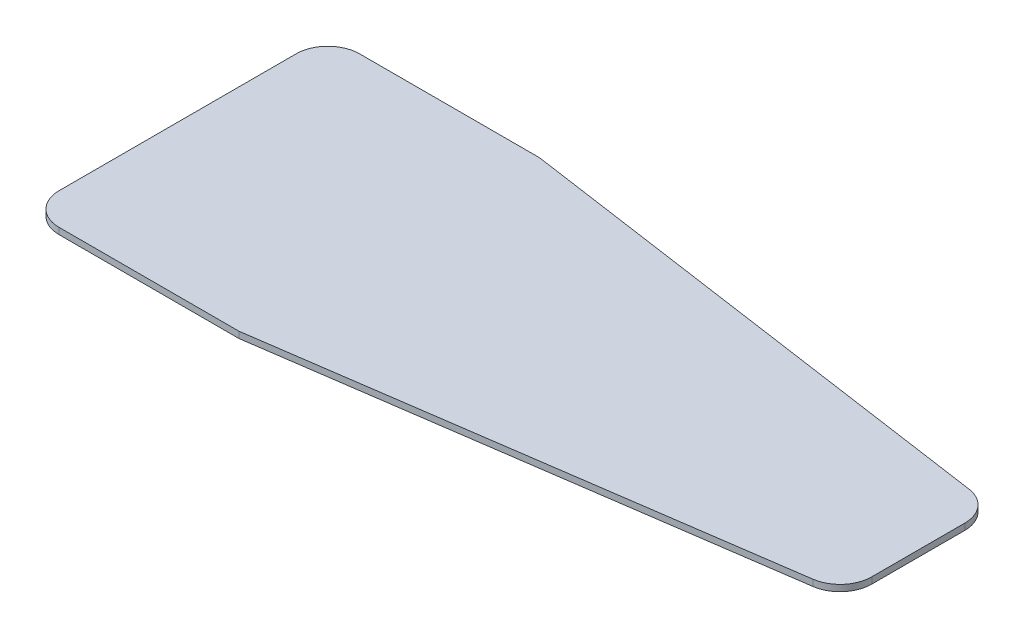
ISO-10303-21;
HEADER;
FILE_DESCRIPTION(('STEP AP214'),'2;1');
FILE_NAME('part.step','',(''),(''),'','','');
FILE_SCHEMA(('AUTOMOTIVE_DESIGN { 1 0 10303 214 1 1 1 1 }'));
ENDSEC;
DATA;
#1=APPLICATION_CONTEXT('core data for automotive mechanical design processes');
#2=APPLICATION_PROTOCOL_DEFINITION('international standard','automotive_design',2000,#1);
#3=PRODUCT_CONTEXT('',#1,'mechanical');
#4=PRODUCT('Part','Part','',(#3));
#5=PRODUCT_RELATED_PRODUCT_CATEGORY('part','',(#4));
#6=PRODUCT_DEFINITION_FORMATION('','',#4);
#7=PRODUCT_DEFINITION_CONTEXT('part definition',#1,'design');
#8=PRODUCT_DEFINITION('design','',#6,#7);
#9=PRODUCT_DEFINITION_SHAPE('','',#8);
#10=(LENGTH_UNIT() NAMED_UNIT(*) SI_UNIT(.MILLI.,.METRE.));
#11=(NAMED_UNIT(*) PLANE_ANGLE_UNIT() SI_UNIT($,.RADIAN.));
#12=(NAMED_UNIT(*) SI_UNIT($,.STERADIAN.) SOLID_ANGLE_UNIT());
#13=UNCERTAINTY_MEASURE_WITH_UNIT(LENGTH_MEASURE(1.E-05),#10,'distance_accuracy_value','');
#14=(GEOMETRIC_REPRESENTATION_CONTEXT(3) GLOBAL_UNCERTAINTY_ASSIGNED_CONTEXT((#13)) GLOBAL_UNIT_ASSIGNED_CONTEXT((#10,
#11,#12)) REPRESENTATION_CONTEXT('',''));
#15=CARTESIAN_POINT('',(0.,0.,0.));
#16=DIRECTION('',(0.,0.,1.));
#17=DIRECTION('',(1.,0.,0.));
#18=AXIS2_PLACEMENT_3D('',#15,#16,#17);
#19=CARTESIAN_POINT('',(335.,3.,-48.9947220363819));
#20=DIRECTION('',(0.,-1.,0.));
#21=DIRECTION('',(0.,0.,-1.));
#22=AXIS2_PLACEMENT_3D('',#19,#20,#21);
#23=CYLINDRICAL_SURFACE('',#22,15.);
#24=CARTESIAN_POINT('',(335.,0.,-48.9947220363819));
#25=DIRECTION('',(0.,1.,0.));
#26=DIRECTION('',(0.,0.,1.));
#27=AXIS2_PLACEMENT_3D('',#24,#25,#26);
#28=CIRCLE('',#27,15.);
#29=CARTESIAN_POINT('',(337.137947494003,0.,-34.1478644391365));
#30=VERTEX_POINT('',#29);
#31=CARTESIAN_POINT('',(350.,0.,-48.994722036382));
#32=VERTEX_POINT('',#31);
#33=EDGE_CURVE('E140',#30,#32,#28,.T.);
#34=ORIENTED_EDGE('',*,*,#33,.T.);
#35=DIRECTION('',(0.,-1.,0.));
#36=VECTOR('',#35,1.);
#37=CARTESIAN_POINT('',(350.,3.,-48.994722036382));
#38=LINE('',#37,#36);
#39=CARTESIAN_POINT('',(350.,3.,-48.994722036382));
#40=VERTEX_POINT('',#39);
#41=EDGE_CURVE('E11',#40,#32,#38,.T.);
#42=ORIENTED_EDGE('',*,*,#41,.F.);
#43=CARTESIAN_POINT('',(335.,3.,-48.9947220363819));
#44=DIRECTION('',(0.,1.,0.));
#45=DIRECTION('',(0.,0.,1.));
#46=AXIS2_PLACEMENT_3D('',#43,#44,#45);
#47=CIRCLE('',#46,15.);
#48=CARTESIAN_POINT('',(337.137947494003,3.,-34.1478644391365));
#49=VERTEX_POINT('',#48);
#50=EDGE_CURVE('E158',#49,#40,#47,.T.);
#51=ORIENTED_EDGE('',*,*,#50,.F.);
#52=DIRECTION('',(0.,-1.,0.));
#53=VECTOR('',#52,1.);
#54=CARTESIAN_POINT('',(337.137947494003,3.,-34.1478644391365));
#55=LINE('',#54,#53);
#56=EDGE_CURVE('E136',#49,#30,#55,.T.);
#57=ORIENTED_EDGE('',*,*,#56,.T.);
#58=EDGE_LOOP('',(#34,#42,#51,#57));
#59=FACE_BOUND('',#58,.T.);
#60=ADVANCED_FACE('F32',(#59),#23,.T.);
#61=CARTESIAN_POINT('',(350.,3.,-48.994722036382));
#62=DIRECTION('',(-1.,0.,0.));
#63=DIRECTION('',(0.,0.,1.));
#64=AXIS2_PLACEMENT_3D('',#61,#62,#63);
#65=PLANE('',#64);
#66=DIRECTION('',(0.,0.,-1.));
#67=VECTOR('',#66,1.);
#68=CARTESIAN_POINT('',(350.,0.,-48.994722036382));
#69=LINE('',#68,#67);
#70=CARTESIAN_POINT('',(350.,0.,-93.005277963618));
#71=VERTEX_POINT('',#70);
#72=EDGE_CURVE('E143',#32,#71,#69,.T.);
#73=ORIENTED_EDGE('',*,*,#72,.T.);
#74=DIRECTION('',(0.,-1.,0.));
#75=VECTOR('',#74,1.);
#76=CARTESIAN_POINT('',(350.,3.,-93.005277963618));
#77=LINE('',#76,#75);
#78=CARTESIAN_POINT('',(350.,3.,-93.005277963618));
#79=VERTEX_POINT('',#78);
#80=EDGE_CURVE('E40',#79,#71,#77,.T.);
#81=ORIENTED_EDGE('',*,*,#80,.F.);
#82=DIRECTION('',(0.,0.,-1.));
#83=VECTOR('',#82,1.);
#84=CARTESIAN_POINT('',(350.,3.,-48.994722036382));
#85=LINE('',#84,#83);
#86=EDGE_CURVE('E97',#40,#79,#85,.T.);
#87=ORIENTED_EDGE('',*,*,#86,.F.);
#88=ORIENTED_EDGE('',*,*,#41,.T.);
#89=EDGE_LOOP('',(#73,#81,#87,#88));
#90=FACE_BOUND('',#89,.T.);
#91=ADVANCED_FACE('F207',(#90),#65,.F.);
#92=CARTESIAN_POINT('',(335.,3.,-93.0052779636181));
#93=DIRECTION('',(0.,-1.,0.));
#94=DIRECTION('',(0.,0.,-1.));
#95=AXIS2_PLACEMENT_3D('',#92,#93,#94);
#96=CYLINDRICAL_SURFACE('',#95,15.);
#97=CARTESIAN_POINT('',(335.,0.,-93.0052779636181));
#98=DIRECTION('',(0.,1.,0.));
#99=DIRECTION('',(0.,0.,-1.));
#100=AXIS2_PLACEMENT_3D('',#97,#98,#99);
#101=CIRCLE('',#100,15.);
#102=CARTESIAN_POINT('',(337.137947494003,0.,-107.852135560864));
#103=VERTEX_POINT('',#102);
#104=EDGE_CURVE('E145',#71,#103,#101,.T.);
#105=ORIENTED_EDGE('',*,*,#104,.T.);
#106=DIRECTION('',(0.,-1.,0.));
#107=VECTOR('',#106,1.);
#108=CARTESIAN_POINT('',(337.137947494003,3.,-107.852135560864));
#109=LINE('',#108,#107);
#110=CARTESIAN_POINT('',(337.137947494003,3.,-107.852135560864));
#111=VERTEX_POINT('',#110);
#112=EDGE_CURVE('E171',#111,#103,#109,.T.);
#113=ORIENTED_EDGE('',*,*,#112,.F.);
#114=CARTESIAN_POINT('',(335.,3.,-93.0052779636181));
#115=DIRECTION('',(0.,1.,0.));
#116=DIRECTION('',(0.,0.,-1.));
#117=AXIS2_PLACEMENT_3D('',#114,#115,#116);
#118=CIRCLE('',#117,15.);
#119=EDGE_CURVE('E179',#79,#111,#118,.T.);
#120=ORIENTED_EDGE('',*,*,#119,.F.);
#121=ORIENTED_EDGE('',*,*,#80,.T.);
#122=EDGE_LOOP('',(#105,#113,#120,#121));
#123=FACE_BOUND('',#122,.T.);
#124=ADVANCED_FACE('F177',(#123),#96,.T.);
#125=CARTESIAN_POINT('',(100.,3.,-142.));
#126=DIRECTION('',(-0.142529832933556,0.,0.98979050648303));
#127=DIRECTION('',(0.98979050648303,0.,0.142529832933556));
#128=AXIS2_PLACEMENT_3D('',#125,#126,#127);
#129=PLANE('',#128);
#130=DIRECTION('',(-0.98979050648303,0.,-0.142529832933556));
#131=VECTOR('',#130,1.);
#132=CARTESIAN_POINT('',(100.,0.,-142.));
#133=LINE('',#132,#131);
#134=CARTESIAN_POINT('',(100.,0.,-142.));
#135=VERTEX_POINT('',#134);
#136=EDGE_CURVE('E147',#103,#135,#133,.T.);
#137=ORIENTED_EDGE('',*,*,#136,.T.);
#138=DIRECTION('',(0.,-1.,0.));
#139=VECTOR('',#138,1.);
#140=CARTESIAN_POINT('',(100.,3.,-142.));
#141=LINE('',#140,#139);
#142=CARTESIAN_POINT('',(100.,3.,-142.));
#143=VERTEX_POINT('',#142);
#144=EDGE_CURVE('E168',#143,#135,#141,.T.);
#145=ORIENTED_EDGE('',*,*,#144,.F.);
#146=DIRECTION('',(-0.98979050648303,0.,-0.142529832933556));
#147=VECTOR('',#146,1.);
#148=CARTESIAN_POINT('',(100.,3.,-142.));
#149=LINE('',#148,#147);
#150=EDGE_CURVE('E197',#111,#143,#149,.T.);
#151=ORIENTED_EDGE('',*,*,#150,.F.);
#152=ORIENTED_EDGE('',*,*,#112,.T.);
#153=EDGE_LOOP('',(#137,#145,#151,#152));
#154=FACE_BOUND('',#153,.T.);
#155=ADVANCED_FACE('F188',(#154),#129,.F.);
#156=CARTESIAN_POINT('',(15.0000000000001,3.,-142.));
#157=DIRECTION('',(0.,0.,1.));
#158=DIRECTION('',(1.,0.,0.));
#159=AXIS2_PLACEMENT_3D('',#156,#157,#158);
#160=PLANE('',#159);
#161=DIRECTION('',(-1.,0.,0.));
#162=VECTOR('',#161,1.);
#163=CARTESIAN_POINT('',(15.0000000000001,0.,-142.));
#164=LINE('',#163,#162);
#165=CARTESIAN_POINT('',(15.0000000000001,0.,-142.));
#166=VERTEX_POINT('',#165);
#167=EDGE_CURVE('E149',#135,#166,#164,.T.);
#168=ORIENTED_EDGE('',*,*,#167,.T.);
#169=DIRECTION('',(0.,-1.,0.));
#170=VECTOR('',#169,1.);
#171=CARTESIAN_POINT('',(15.0000000000001,3.,-142.));
#172=LINE('',#171,#170);
#173=CARTESIAN_POINT('',(15.0000000000001,3.,-142.));
#174=VERTEX_POINT('',#173);
#175=EDGE_CURVE('E165',#174,#166,#172,.T.);
#176=ORIENTED_EDGE('',*,*,#175,.F.);
#177=DIRECTION('',(-1.,0.,0.));
#178=VECTOR('',#177,1.);
#179=CARTESIAN_POINT('',(15.0000000000001,3.,-142.));
#180=LINE('',#179,#178);
#181=EDGE_CURVE('E194',#143,#174,#180,.T.);
#182=ORIENTED_EDGE('',*,*,#181,.F.);
#183=ORIENTED_EDGE('',*,*,#144,.T.);
#184=EDGE_LOOP('',(#168,#176,#182,#183));
#185=FACE_BOUND('',#184,.T.);
#186=ADVANCED_FACE('F192',(#185),#160,.F.);
#187=CARTESIAN_POINT('',(15.,3.,-127.));
#188=DIRECTION('',(0.,-1.,0.));
#189=DIRECTION('',(0.,0.,-1.));
#190=AXIS2_PLACEMENT_3D('',#187,#188,#189);
#191=CYLINDRICAL_SURFACE('',#190,15.);
#192=CARTESIAN_POINT('',(15.,0.,-127.));
#193=DIRECTION('',(0.,1.,0.));
#194=DIRECTION('',(0.,0.,-1.));
#195=AXIS2_PLACEMENT_3D('',#192,#193,#194);
#196=CIRCLE('',#195,15.);
#197=CARTESIAN_POINT('',(0.,0.,-127.));
#198=VERTEX_POINT('',#197);
#199=EDGE_CURVE('E151',#166,#198,#196,.T.);
#200=ORIENTED_EDGE('',*,*,#199,.T.);
#201=DIRECTION('',(0.,-1.,0.));
#202=VECTOR('',#201,1.);
#203=CARTESIAN_POINT('',(0.,3.,-127.));
#204=LINE('',#203,#202);
#205=CARTESIAN_POINT('',(0.,3.,-127.));
#206=VERTEX_POINT('',#205);
#207=EDGE_CURVE('E162',#206,#198,#204,.T.);
#208=ORIENTED_EDGE('',*,*,#207,.F.);
#209=CARTESIAN_POINT('',(15.,3.,-127.));
#210=DIRECTION('',(0.,1.,0.));
#211=DIRECTION('',(0.,0.,-1.));
#212=AXIS2_PLACEMENT_3D('',#209,#210,#211);
#213=CIRCLE('',#212,15.);
#214=EDGE_CURVE('E196',#174,#206,#213,.T.);
#215=ORIENTED_EDGE('',*,*,#214,.F.);
#216=ORIENTED_EDGE('',*,*,#175,.T.);
#217=EDGE_LOOP('',(#200,#208,#215,#216));
#218=FACE_BOUND('',#217,.T.);
#219=ADVANCED_FACE('F219',(#218),#191,.T.);
#220=CARTESIAN_POINT('',(0.,3.,-15.0000000000001));
#221=DIRECTION('',(1.,0.,0.));
#222=DIRECTION('',(0.,0.,-1.));
#223=AXIS2_PLACEMENT_3D('',#220,#221,#222);
#224=PLANE('',#223);
#225=DIRECTION('',(0.,0.,1.));
#226=VECTOR('',#225,1.);
#227=CARTESIAN_POINT('',(0.,0.,-15.0000000000001));
#228=LINE('',#227,#226);
#229=CARTESIAN_POINT('',(0.,0.,-15.0000000000001));
#230=VERTEX_POINT('',#229);
#231=EDGE_CURVE('E153',#198,#230,#228,.T.);
#232=ORIENTED_EDGE('',*,*,#231,.T.);
#233=DIRECTION('',(0.,-1.,0.));
#234=VECTOR('',#233,1.);
#235=CARTESIAN_POINT('',(0.,3.,-15.0000000000001));
#236=LINE('',#235,#234);
#237=CARTESIAN_POINT('',(0.,3.,-15.0000000000001));
#238=VERTEX_POINT('',#237);
#239=EDGE_CURVE('E131',#238,#230,#236,.T.);
#240=ORIENTED_EDGE('',*,*,#239,.F.);
#241=DIRECTION('',(0.,0.,1.));
#242=VECTOR('',#241,1.);
#243=CARTESIAN_POINT('',(0.,3.,-15.0000000000001));
#244=LINE('',#243,#242);
#245=EDGE_CURVE('E122',#206,#238,#244,.T.);
#246=ORIENTED_EDGE('',*,*,#245,.F.);
#247=ORIENTED_EDGE('',*,*,#207,.T.);
#248=EDGE_LOOP('',(#232,#240,#246,#247));
#249=FACE_BOUND('',#248,.T.);
#250=ADVANCED_FACE('F222',(#249),#224,.F.);
#251=CARTESIAN_POINT('',(15.,3.,-15.));
#252=DIRECTION('',(0.,-1.,0.));
#253=DIRECTION('',(0.,0.,-1.));
#254=AXIS2_PLACEMENT_3D('',#251,#252,#253);
#255=CYLINDRICAL_SURFACE('',#254,15.);
#256=CARTESIAN_POINT('',(15.,0.,-15.));
#257=DIRECTION('',(0.,1.,0.));
#258=DIRECTION('',(0.,0.,-1.));
#259=AXIS2_PLACEMENT_3D('',#256,#257,#258);
#260=CIRCLE('',#259,15.);
#261=CARTESIAN_POINT('',(15.0000000000001,0.,0.));
#262=VERTEX_POINT('',#261);
#263=EDGE_CURVE('E130',#230,#262,#260,.T.);
#264=ORIENTED_EDGE('',*,*,#263,.T.);
#265=DIRECTION('',(0.,-1.,0.));
#266=VECTOR('',#265,1.);
#267=CARTESIAN_POINT('',(15.0000000000001,3.,0.));
#268=LINE('',#267,#266);
#269=CARTESIAN_POINT('',(15.0000000000001,3.,0.));
#270=VERTEX_POINT('',#269);
#271=EDGE_CURVE('E127',#270,#262,#268,.T.);
#272=ORIENTED_EDGE('',*,*,#271,.F.);
#273=CARTESIAN_POINT('',(15.,3.,-15.));
#274=DIRECTION('',(0.,1.,0.));
#275=DIRECTION('',(0.,0.,-1.));
#276=AXIS2_PLACEMENT_3D('',#273,#274,#275);
#277=CIRCLE('',#276,15.);
#278=EDGE_CURVE('E116',#238,#270,#277,.T.);
#279=ORIENTED_EDGE('',*,*,#278,.F.);
#280=ORIENTED_EDGE('',*,*,#239,.T.);
#281=EDGE_LOOP('',(#264,#272,#279,#280));
#282=FACE_BOUND('',#281,.T.);
#283=ADVANCED_FACE('F128',(#282),#255,.T.);
#284=CARTESIAN_POINT('',(15.0000000000001,3.,0.));
#285=DIRECTION('',(0.,0.,-1.));
#286=DIRECTION('',(-1.,0.,0.));
#287=AXIS2_PLACEMENT_3D('',#284,#285,#286);
#288=PLANE('',#287);
#289=DIRECTION('',(1.,0.,0.));
#290=VECTOR('',#289,1.);
#291=CARTESIAN_POINT('',(15.0000000000001,0.,0.));
#292=LINE('',#291,#290);
#293=CARTESIAN_POINT('',(100.,0.,0.));
#294=VERTEX_POINT('',#293);
#295=EDGE_CURVE('E83',#262,#294,#292,.T.);
#296=ORIENTED_EDGE('',*,*,#295,.T.);
#297=DIRECTION('',(0.,-1.,0.));
#298=VECTOR('',#297,1.);
#299=CARTESIAN_POINT('',(100.,3.,0.));
#300=LINE('',#299,#298);
#301=CARTESIAN_POINT('',(100.,3.,0.));
#302=VERTEX_POINT('',#301);
#303=EDGE_CURVE('E132',#302,#294,#300,.T.);
#304=ORIENTED_EDGE('',*,*,#303,.F.);
#305=DIRECTION('',(1.,0.,0.));
#306=VECTOR('',#305,1.);
#307=CARTESIAN_POINT('',(15.0000000000001,3.,0.));
#308=LINE('',#307,#306);
#309=EDGE_CURVE('E120',#270,#302,#308,.T.);
#310=ORIENTED_EDGE('',*,*,#309,.F.);
#311=ORIENTED_EDGE('',*,*,#271,.T.);
#312=EDGE_LOOP('',(#296,#304,#310,#311));
#313=FACE_BOUND('',#312,.T.);
#314=ADVANCED_FACE('F134',(#313),#288,.F.);
#315=CARTESIAN_POINT('',(337.137947494003,3.,-34.1478644391365));
#316=DIRECTION('',(-0.142529832933556,0.,-0.98979050648303));
#317=DIRECTION('',(-0.98979050648303,0.,0.142529832933556));
#318=AXIS2_PLACEMENT_3D('',#315,#316,#317);
#319=PLANE('',#318);
#320=DIRECTION('',(0.98979050648303,0.,-0.142529832933556));
#321=VECTOR('',#320,1.);
#322=CARTESIAN_POINT('',(337.137947494003,0.,-34.1478644391365));
#323=LINE('',#322,#321);
#324=EDGE_CURVE('E89',#294,#30,#323,.T.);
#325=ORIENTED_EDGE('',*,*,#324,.T.);
#326=ORIENTED_EDGE('',*,*,#56,.F.);
#327=DIRECTION('',(0.98979050648303,0.,-0.142529832933556));
#328=VECTOR('',#327,1.);
#329=CARTESIAN_POINT('',(337.137947494003,3.,-34.1478644391365));
#330=LINE('',#329,#328);
#331=EDGE_CURVE('E48',#302,#49,#330,.T.);
#332=ORIENTED_EDGE('',*,*,#331,.F.);
#333=ORIENTED_EDGE('',*,*,#303,.T.);
#334=EDGE_LOOP('',(#325,#326,#332,#333));
#335=FACE_BOUND('',#334,.T.);
#336=ADVANCED_FACE('F231',(#335),#319,.F.);
#337=CARTESIAN_POINT('',(335.,3.,-48.9947220363819));
#338=DIRECTION('',(0.,1.,0.));
#339=DIRECTION('',(0.,0.,1.));
#340=AXIS2_PLACEMENT_3D('',#337,#338,#339);
#341=PLANE('',#340);
#342=ORIENTED_EDGE('',*,*,#50,.T.);
#343=ORIENTED_EDGE('',*,*,#86,.T.);
#344=ORIENTED_EDGE('',*,*,#119,.T.);
#345=ORIENTED_EDGE('',*,*,#150,.T.);
#346=ORIENTED_EDGE('',*,*,#181,.T.);
#347=ORIENTED_EDGE('',*,*,#214,.T.);
#348=ORIENTED_EDGE('',*,*,#245,.T.);
#349=ORIENTED_EDGE('',*,*,#278,.T.);
#350=ORIENTED_EDGE('',*,*,#309,.T.);
#351=ORIENTED_EDGE('',*,*,#331,.T.);
#352=EDGE_LOOP('',(#342,#343,#344,#345,#346,#347,#348,#349,#350,#351));
#353=FACE_BOUND('',#352,.T.);
#354=ADVANCED_FACE('F118',(#353),#341,.T.);
#355=CARTESIAN_POINT('',(335.,0.,-48.9947220363819));
#356=DIRECTION('',(0.,1.,0.));
#357=DIRECTION('',(0.,0.,1.));
#358=AXIS2_PLACEMENT_3D('',#355,#356,#357);
#359=PLANE('',#358);
#360=ORIENTED_EDGE('',*,*,#33,.F.);
#361=ORIENTED_EDGE('',*,*,#324,.F.);
#362=ORIENTED_EDGE('',*,*,#295,.F.);
#363=ORIENTED_EDGE('',*,*,#263,.F.);
#364=ORIENTED_EDGE('',*,*,#231,.F.);
#365=ORIENTED_EDGE('',*,*,#199,.F.);
#366=ORIENTED_EDGE('',*,*,#167,.F.);
#367=ORIENTED_EDGE('',*,*,#136,.F.);
#368=ORIENTED_EDGE('',*,*,#104,.F.);
#369=ORIENTED_EDGE('',*,*,#72,.F.);
#370=EDGE_LOOP('',(#360,#361,#362,#363,#364,#365,#366,#367,#368,#369));
#371=FACE_BOUND('',#370,.T.);
#372=ADVANCED_FACE('F183',(#371),#359,.F.);
#373=CLOSED_SHELL('',(#60,#91,#124,#155,#186,#219,#250,#283,#314,#336,#354,#372));
#374=MANIFOLD_SOLID_BREP('B2',#373);
#375=ADVANCED_BREP_SHAPE_REPRESENTATION('',(#18,#374),#14);
#376=SHAPE_DEFINITION_REPRESENTATION(#9,#375);
ENDSEC;
END-ISO-10303-21;
